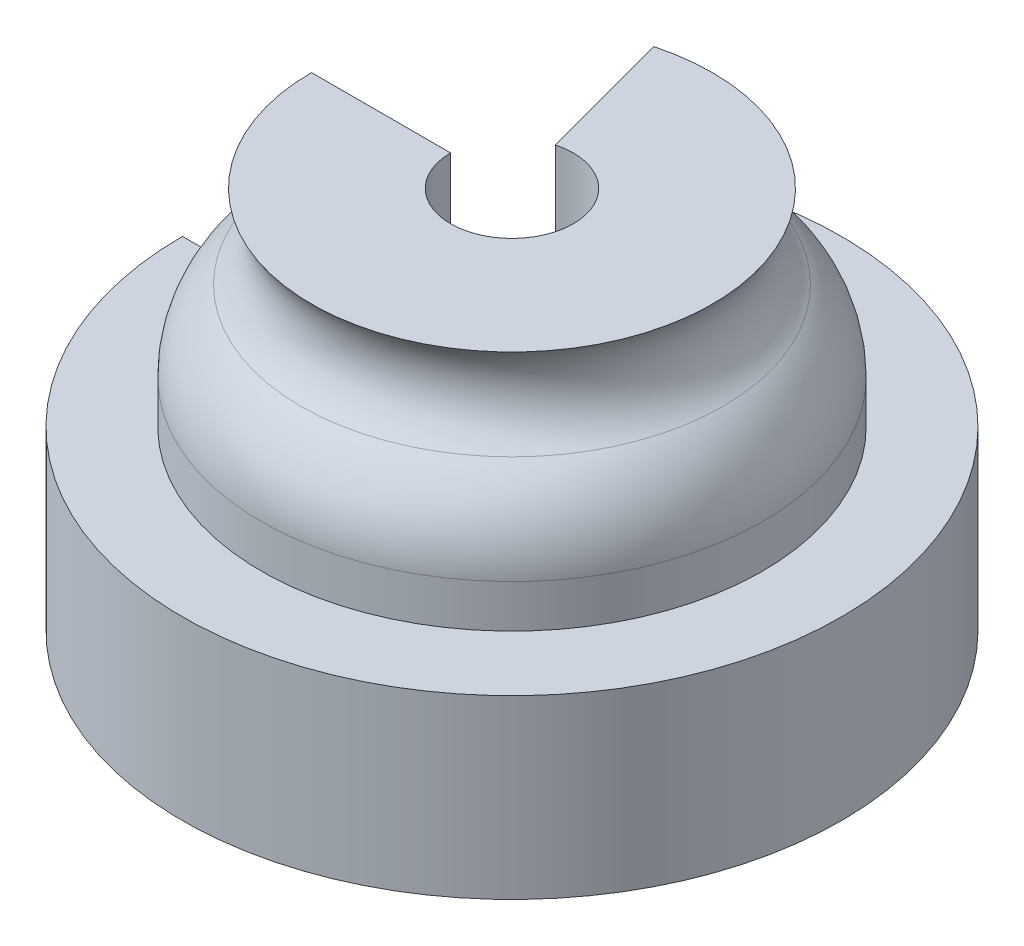
ISO-10303-21;
HEADER;
FILE_DESCRIPTION(('STEP AP214'),'2;1');
FILE_NAME('part.step','',(''),(''),'','','');
FILE_SCHEMA(('AUTOMOTIVE_DESIGN { 1 0 10303 214 1 1 1 1 }'));
ENDSEC;
DATA;
#1=APPLICATION_CONTEXT('core data for automotive mechanical design processes');
#2=APPLICATION_PROTOCOL_DEFINITION('international standard','automotive_design',2000,#1);
#3=PRODUCT_CONTEXT('',#1,'mechanical');
#4=PRODUCT('Part','Part','',(#3));
#5=PRODUCT_RELATED_PRODUCT_CATEGORY('part','',(#4));
#6=PRODUCT_DEFINITION_FORMATION('','',#4);
#7=PRODUCT_DEFINITION_CONTEXT('part definition',#1,'design');
#8=PRODUCT_DEFINITION('design','',#6,#7);
#9=PRODUCT_DEFINITION_SHAPE('','',#8);
#10=(LENGTH_UNIT() NAMED_UNIT(*) SI_UNIT(.MILLI.,.METRE.));
#11=(NAMED_UNIT(*) PLANE_ANGLE_UNIT() SI_UNIT($,.RADIAN.));
#12=(NAMED_UNIT(*) SI_UNIT($,.STERADIAN.) SOLID_ANGLE_UNIT());
#13=UNCERTAINTY_MEASURE_WITH_UNIT(LENGTH_MEASURE(1.E-05),#10,'distance_accuracy_value','');
#14=(GEOMETRIC_REPRESENTATION_CONTEXT(3) GLOBAL_UNCERTAINTY_ASSIGNED_CONTEXT((#13)) GLOBAL_UNIT_ASSIGNED_CONTEXT((#10,
#11,#12)) REPRESENTATION_CONTEXT('',''));
#15=CARTESIAN_POINT('',(0.,0.,0.));
#16=DIRECTION('',(0.,0.,1.));
#17=DIRECTION('',(1.,0.,0.));
#18=AXIS2_PLACEMENT_3D('',#15,#16,#17);
#19=CARTESIAN_POINT('',(-7.03311507822036,34.0911466692464,-26.247942807396));
#20=DIRECTION('',(0.965925826289065,0.,-0.258819045102531));
#21=DIRECTION('',(-0.258819045102531,0.,-0.965925826289065));
#22=AXIS2_PLACEMENT_3D('',#19,#20,#21);
#23=PLANE('',#22);
#24=DIRECTION('',(0.258819045102531,0.,0.965925826289065));
#25=VECTOR('',#24,1.);
#26=CARTESIAN_POINT('',(-7.03311507822036,-4.,-26.247942807396));
#27=LINE('',#26,#25);
#28=CARTESIAN_POINT('',(-9.37629092757959,-4.,-34.9927941282726));
#29=VERTEX_POINT('',#28);
#30=CARTESIAN_POINT('',(-1.74618892919665,-4.,-6.51686580337591));
#31=VERTEX_POINT('',#30);
#32=EDGE_CURVE('E238',#29,#31,#27,.T.);
#33=ORIENTED_EDGE('',*,*,#32,.T.);
#34=DIRECTION('',(0.,1.,0.));
#35=VECTOR('',#34,1.);
#36=CARTESIAN_POINT('',(-1.74618892919665,34.0911466692464,-6.51686580337591));
#37=LINE('',#36,#35);
#38=CARTESIAN_POINT('',(-1.74618892919665,38.0911466692464,-6.51686580337591));
#39=VERTEX_POINT('',#38);
#40=EDGE_CURVE('E241',#31,#39,#37,.T.);
#41=ORIENTED_EDGE('',*,*,#40,.T.);
#42=DIRECTION('',(-0.258819045102531,0.,-0.965925826289065));
#43=VECTOR('',#42,1.);
#44=CARTESIAN_POINT('',(-7.03311507822036,38.0911466692464,-26.247942807396));
#45=LINE('',#44,#43);
#46=CARTESIAN_POINT('',(-5.70418653603872,38.0911466692464,-21.2883139683459));
#47=VERTEX_POINT('',#46);
#48=EDGE_CURVE('E244',#39,#47,#45,.T.);
#49=ORIENTED_EDGE('',*,*,#48,.T.);
#50=CARTESIAN_POINT('',(-7.03311507822036,34.0911466692464,-26.247942807396));
#51=DIRECTION('',(0.965925826289065,0.,-0.258819045102531));
#52=DIRECTION('',(-0.258819045102531,0.,-0.965925826289065));
#53=AXIS2_PLACEMENT_3D('',#50,#51,#52);
#54=CIRCLE('',#53,6.50876096437431);
#55=CARTESIAN_POINT('',(-6.00541743260004,28.9338836760073,-22.4125229791222));
#56=VERTEX_POINT('',#55);
#57=EDGE_CURVE('E247',#47,#56,#54,.T.);
#58=ORIENTED_EDGE('',*,*,#57,.T.);
#59=CARTESIAN_POINT('',(-4.24996507300734,20.1245519342216,-15.8610855828559));
#60=DIRECTION('',(0.965925826289065,0.,-0.258819045102531));
#61=DIRECTION('',(-0.258819045102531,0.,-0.965925826289065));
#62=AXIS2_PLACEMENT_3D('',#59,#60,#61);
#63=CIRCLE('',#62,11.1178806739787);
#64=CARTESIAN_POINT('',(-7.12748433261041,20.1245519342216,-26.600133659452));
#65=VERTEX_POINT('',#64);
#66=EDGE_CURVE('E250',#56,#65,#63,.F.);
#67=ORIENTED_EDGE('',*,*,#66,.T.);
#68=DIRECTION('',(0.,-1.,0.));
#69=VECTOR('',#68,1.);
#70=CARTESIAN_POINT('',(-7.12748433261041,34.0911466692464,-26.600133659452));
#71=LINE('',#70,#69);
#72=CARTESIAN_POINT('',(-7.12748433261041,15.4039294880772,-26.600133659452));
#73=VERTEX_POINT('',#72);
#74=EDGE_CURVE('E253',#65,#73,#71,.T.);
#75=ORIENTED_EDGE('',*,*,#74,.T.);
#76=DIRECTION('',(-0.258819045102531,0.,-0.965925826289065));
#77=VECTOR('',#76,1.);
#78=CARTESIAN_POINT('',(-7.03311507822036,15.4039294880772,-26.247942807396));
#79=LINE('',#78,#77);
#80=CARTESIAN_POINT('',(-9.37629092757959,15.4039294880772,-34.9927941282726));
#81=VERTEX_POINT('',#80);
#82=EDGE_CURVE('E256',#73,#81,#79,.T.);
#83=ORIENTED_EDGE('',*,*,#82,.T.);
#84=DIRECTION('',(0.,-1.,0.));
#85=VECTOR('',#84,1.);
#86=CARTESIAN_POINT('',(-9.37629092757959,34.0911466692464,-34.9927941282726));
#87=LINE('',#86,#85);
#88=EDGE_CURVE('E259',#81,#29,#87,.T.);
#89=ORIENTED_EDGE('',*,*,#88,.T.);
#90=EDGE_LOOP('',(#33,#41,#49,#58,#67,#75,#83,#89));
#91=FACE_BOUND('',#90,.T.);
#92=DIRECTION('',(0.258819045102531,0.,0.965925826289065));
#93=VECTOR('',#92,1.);
#94=CARTESIAN_POINT('',(-8.34101474716946,0.,-31.1290908231163));
#95=LINE('',#94,#93);
#96=CARTESIAN_POINT('',(-8.34101474716946,0.,-31.1290908231163));
#97=VERTEX_POINT('',#96);
#98=CARTESIAN_POINT('',(-2.78146510960678,0.,-10.3805691085322));
#99=VERTEX_POINT('',#98);
#100=EDGE_CURVE('E50',#97,#99,#95,.T.);
#101=ORIENTED_EDGE('',*,*,#100,.F.);
#102=DIRECTION('',(0.,-1.,0.));
#103=VECTOR('',#102,1.);
#104=CARTESIAN_POINT('',(-8.34101474716946,11.4039294880772,-31.1290908231163));
#105=LINE('',#104,#103);
#106=CARTESIAN_POINT('',(-8.34101474716946,11.4039294880772,-31.1290908231163));
#107=VERTEX_POINT('',#106);
#108=EDGE_CURVE('E155',#107,#97,#105,.T.);
#109=ORIENTED_EDGE('',*,*,#108,.F.);
#110=DIRECTION('',(-0.258819045102531,0.,-0.965925826289065));
#111=VECTOR('',#110,1.);
#112=CARTESIAN_POINT('',(-6.09220815220029,11.4039294880772,-22.7364303542958));
#113=LINE('',#112,#111);
#114=CARTESIAN_POINT('',(-6.09220815220029,11.4039294880772,-22.7364303542958));
#115=VERTEX_POINT('',#114);
#116=EDGE_CURVE('E196',#115,#107,#113,.T.);
#117=ORIENTED_EDGE('',*,*,#116,.F.);
#118=DIRECTION('',(0.,-1.,0.));
#119=VECTOR('',#118,1.);
#120=CARTESIAN_POINT('',(-6.09220815220029,20.1245519342216,-22.7364303542958));
#121=LINE('',#120,#119);
#122=CARTESIAN_POINT('',(-6.09220815220029,20.1245519342216,-22.7364303542958));
#123=VERTEX_POINT('',#122);
#124=EDGE_CURVE('E193',#123,#115,#121,.T.);
#125=ORIENTED_EDGE('',*,*,#124,.F.);
#126=CARTESIAN_POINT('',(-4.24996507300734,20.1245519342216,-15.8610855828559));
#127=DIRECTION('',(-0.965925826289065,0.,0.258819045102531));
#128=DIRECTION('',(0.258819045102531,0.,0.965925826289065));
#129=AXIS2_PLACEMENT_3D('',#126,#127,#128);
#130=CIRCLE('',#129,7.11788067397874);
#131=CARTESIAN_POINT('',(-5.37383937880735,25.7644552570088,-20.0554415934225));
#132=VERTEX_POINT('',#131);
#133=EDGE_CURVE('E190',#132,#123,#130,.T.);
#134=ORIENTED_EDGE('',*,*,#133,.F.);
#135=CARTESIAN_POINT('',(-7.03311507822036,34.0911466692464,-26.247942807396));
#136=DIRECTION('',(0.965925826289065,0.,-0.258819045102531));
#137=DIRECTION('',(-0.258819045102531,0.,-0.965925826289065));
#138=AXIS2_PLACEMENT_3D('',#135,#136,#137);
#139=CIRCLE('',#138,10.5087609643743);
#140=CARTESIAN_POINT('',(-4.31324760021025,34.0911466692464,-16.0972591896085));
#141=VERTEX_POINT('',#140);
#142=EDGE_CURVE('E187',#141,#132,#139,.T.);
#143=ORIENTED_EDGE('',*,*,#142,.F.);
#144=DIRECTION('',(-0.258819045102531,0.,-0.965925826289065));
#145=VECTOR('',#144,1.);
#146=CARTESIAN_POINT('',(-2.78146510960678,34.0911466692464,-10.3805691085322));
#147=LINE('',#146,#145);
#148=CARTESIAN_POINT('',(-2.78146510960678,34.0911466692464,-10.3805691085322));
#149=VERTEX_POINT('',#148);
#150=EDGE_CURVE('E184',#149,#141,#147,.T.);
#151=ORIENTED_EDGE('',*,*,#150,.F.);
#152=DIRECTION('',(0.,1.,0.));
#153=VECTOR('',#152,1.);
#154=CARTESIAN_POINT('',(-2.78146510960678,0.,-10.3805691085322));
#155=LINE('',#154,#153);
#156=EDGE_CURVE('E182',#99,#149,#155,.T.);
#157=ORIENTED_EDGE('',*,*,#156,.F.);
#158=EDGE_LOOP('',(#101,#109,#117,#125,#134,#143,#151,#157));
#159=FACE_BOUND('',#158,.T.);
#160=ADVANCED_FACE('F35',(#91,#159),#23,.F.);
#161=CARTESIAN_POINT('',(-27.1738699732633,34.0911466692464,0.));
#162=DIRECTION('',(0.,0.,-1.));
#163=DIRECTION('',(-1.,0.,0.));
#164=AXIS2_PLACEMENT_3D('',#161,#162,#163);
#165=PLANE('',#164);
#166=DIRECTION('',(1.,0.,0.));
#167=VECTOR('',#166,1.);
#168=CARTESIAN_POINT('',(-27.1738699732633,-4.,0.));
#169=LINE('',#168,#167);
#170=CARTESIAN_POINT('',(-36.2272062469945,-4.,0.));
#171=VERTEX_POINT('',#170);
#172=CARTESIAN_POINT('',(-6.74675593716412,-4.,0.));
#173=VERTEX_POINT('',#172);
#174=EDGE_CURVE('E214',#171,#173,#169,.T.);
#175=ORIENTED_EDGE('',*,*,#174,.F.);
#176=DIRECTION('',(0.,-1.,0.));
#177=VECTOR('',#176,1.);
#178=CARTESIAN_POINT('',(-36.2272062469945,34.0911466692464,0.));
#179=LINE('',#178,#177);
#180=CARTESIAN_POINT('',(-36.2272062469945,15.4039294880772,0.));
#181=VERTEX_POINT('',#180);
#182=EDGE_CURVE('E235',#181,#171,#179,.T.);
#183=ORIENTED_EDGE('',*,*,#182,.F.);
#184=DIRECTION('',(-1.,0.,0.));
#185=VECTOR('',#184,1.);
#186=CARTESIAN_POINT('',(-27.1738699732633,15.4039294880772,0.));
#187=LINE('',#186,#185);
#188=CARTESIAN_POINT('',(-27.5384847733553,15.4039294880772,0.));
#189=VERTEX_POINT('',#188);
#190=EDGE_CURVE('E232',#189,#181,#187,.T.);
#191=ORIENTED_EDGE('',*,*,#190,.F.);
#192=DIRECTION('',(0.,-1.,0.));
#193=VECTOR('',#192,1.);
#194=CARTESIAN_POINT('',(-27.5384847733553,34.0911466692464,0.));
#195=LINE('',#194,#193);
#196=CARTESIAN_POINT('',(-27.5384847733553,20.1245519342216,0.));
#197=VERTEX_POINT('',#196);
#198=EDGE_CURVE('E229',#197,#189,#195,.T.);
#199=ORIENTED_EDGE('',*,*,#198,.F.);
#200=CARTESIAN_POINT('',(-16.4206040993765,20.1245519342216,0.));
#201=DIRECTION('',(0.,0.,-1.));
#202=DIRECTION('',(-1.,0.,0.));
#203=AXIS2_PLACEMENT_3D('',#200,#201,#202);
#204=CIRCLE('',#203,11.1178806739787);
#205=CARTESIAN_POINT('',(-23.2031511831789,28.9338836760073,0.));
#206=VERTEX_POINT('',#205);
#207=EDGE_CURVE('E226',#206,#197,#204,.F.);
#208=ORIENTED_EDGE('',*,*,#207,.F.);
#209=CARTESIAN_POINT('',(-27.1738699732633,34.0911466692464,0.));
#210=DIRECTION('',(0.,0.,-1.));
#211=DIRECTION('',(-1.,0.,0.));
#212=AXIS2_PLACEMENT_3D('',#209,#210,#211);
#213=CIRCLE('',#212,6.50876096437431);
#214=CARTESIAN_POINT('',(-22.0392843725198,38.0911466692464,0.));
#215=VERTEX_POINT('',#214);
#216=EDGE_CURVE('E223',#215,#206,#213,.T.);
#217=ORIENTED_EDGE('',*,*,#216,.F.);
#218=DIRECTION('',(-1.,0.,0.));
#219=VECTOR('',#218,1.);
#220=CARTESIAN_POINT('',(-27.1738699732633,38.0911466692464,0.));
#221=LINE('',#220,#219);
#222=CARTESIAN_POINT('',(-6.74675593716412,38.0911466692464,0.));
#223=VERTEX_POINT('',#222);
#224=EDGE_CURVE('E220',#223,#215,#221,.T.);
#225=ORIENTED_EDGE('',*,*,#224,.F.);
#226=DIRECTION('',(0.,1.,0.));
#227=VECTOR('',#226,1.);
#228=CARTESIAN_POINT('',(-6.74675593716412,34.0911466692464,0.));
#229=LINE('',#228,#227);
#230=EDGE_CURVE('E217',#173,#223,#229,.T.);
#231=ORIENTED_EDGE('',*,*,#230,.F.);
#232=EDGE_LOOP('',(#175,#183,#191,#199,#208,#217,#225,#231));
#233=FACE_BOUND('',#232,.T.);
#234=DIRECTION('',(0.,-1.,0.));
#235=VECTOR('',#234,1.);
#236=CARTESIAN_POINT('',(-32.2272062469945,11.4039294880772,0.));
#237=LINE('',#236,#235);
#238=CARTESIAN_POINT('',(-32.2272062469945,11.4039294880772,0.));
#239=VERTEX_POINT('',#238);
#240=CARTESIAN_POINT('',(-32.2272062469945,0.,0.));
#241=VERTEX_POINT('',#240);
#242=EDGE_CURVE('E165',#239,#241,#237,.T.);
#243=ORIENTED_EDGE('',*,*,#242,.T.);
#244=DIRECTION('',(1.,0.,0.));
#245=VECTOR('',#244,1.);
#246=CARTESIAN_POINT('',(-32.2272062469945,0.,0.));
#247=LINE('',#246,#245);
#248=CARTESIAN_POINT('',(-10.7467559371641,0.,0.));
#249=VERTEX_POINT('',#248);
#250=EDGE_CURVE('E149',#241,#249,#247,.T.);
#251=ORIENTED_EDGE('',*,*,#250,.T.);
#252=DIRECTION('',(0.,1.,0.));
#253=VECTOR('',#252,1.);
#254=CARTESIAN_POINT('',(-10.7467559371641,0.,0.));
#255=LINE('',#254,#253);
#256=CARTESIAN_POINT('',(-10.7467559371641,34.0911466692464,0.));
#257=VERTEX_POINT('',#256);
#258=EDGE_CURVE('E158',#249,#257,#255,.T.);
#259=ORIENTED_EDGE('',*,*,#258,.T.);
#260=DIRECTION('',(-1.,0.,0.));
#261=VECTOR('',#260,1.);
#262=CARTESIAN_POINT('',(-10.7467559371641,34.0911466692464,0.));
#263=LINE('',#262,#261);
#264=CARTESIAN_POINT('',(-16.665109008889,34.0911466692464,0.));
#265=VERTEX_POINT('',#264);
#266=EDGE_CURVE('E58',#257,#265,#263,.T.);
#267=ORIENTED_EDGE('',*,*,#266,.T.);
#268=CARTESIAN_POINT('',(-27.1738699732633,34.0911466692464,0.));
#269=DIRECTION('',(0.,0.,-1.));
#270=DIRECTION('',(-1.,0.,0.));
#271=AXIS2_PLACEMENT_3D('',#268,#269,#270);
#272=CIRCLE('',#271,10.5087609643743);
#273=CARTESIAN_POINT('',(-20.762920969276,25.7644552570088,0.));
#274=VERTEX_POINT('',#273);
#275=EDGE_CURVE('E169',#265,#274,#272,.T.);
#276=ORIENTED_EDGE('',*,*,#275,.T.);
#277=CARTESIAN_POINT('',(-16.4206040993765,20.1245519342216,0.));
#278=DIRECTION('',(0.,0.,1.));
#279=DIRECTION('',(1.,0.,0.));
#280=AXIS2_PLACEMENT_3D('',#277,#278,#279);
#281=CIRCLE('',#280,7.11788067397874);
#282=CARTESIAN_POINT('',(-23.5384847733553,20.1245519342216,0.));
#283=VERTEX_POINT('',#282);
#284=EDGE_CURVE('E172',#274,#283,#281,.T.);
#285=ORIENTED_EDGE('',*,*,#284,.T.);
#286=DIRECTION('',(0.,-1.,0.));
#287=VECTOR('',#286,1.);
#288=CARTESIAN_POINT('',(-23.5384847733553,20.1245519342216,0.));
#289=LINE('',#288,#287);
#290=CARTESIAN_POINT('',(-23.5384847733553,11.4039294880772,0.));
#291=VERTEX_POINT('',#290);
#292=EDGE_CURVE('E175',#283,#291,#289,.T.);
#293=ORIENTED_EDGE('',*,*,#292,.T.);
#294=DIRECTION('',(-1.,0.,0.));
#295=VECTOR('',#294,1.);
#296=CARTESIAN_POINT('',(-23.5384847733553,11.4039294880772,0.));
#297=LINE('',#296,#295);
#298=EDGE_CURVE('E178',#291,#239,#297,.T.);
#299=ORIENTED_EDGE('',*,*,#298,.T.);
#300=EDGE_LOOP('',(#243,#251,#259,#267,#276,#285,#293,#299));
#301=FACE_BOUND('',#300,.T.);
#302=ADVANCED_FACE('F162',(#233,#301),#165,.T.);
#303=CARTESIAN_POINT('',(-7.03311507822036,-4.,-26.247942807396));
#304=DIRECTION('',(0.,1.,0.));
#305=DIRECTION('',(0.,0.,1.));
#306=AXIS2_PLACEMENT_3D('',#303,#304,#305);
#307=PLANE('',#306);
#308=CARTESIAN_POINT('',(0.,-4.,0.));
#309=DIRECTION('',(0.,-1.,0.));
#310=DIRECTION('',(0.,0.,-1.));
#311=AXIS2_PLACEMENT_3D('',#308,#309,#310);
#312=CIRCLE('',#311,36.2272062469945);
#313=EDGE_CURVE('E11',#29,#171,#312,.T.);
#314=ORIENTED_EDGE('',*,*,#313,.T.);
#315=ORIENTED_EDGE('',*,*,#174,.T.);
#316=CARTESIAN_POINT('',(0.,-4.,0.));
#317=DIRECTION('',(0.,-1.,0.));
#318=DIRECTION('',(0.,0.,-1.));
#319=AXIS2_PLACEMENT_3D('',#316,#317,#318);
#320=CIRCLE('',#319,6.74675593716412);
#321=EDGE_CURVE('E262',#31,#173,#320,.T.);
#322=ORIENTED_EDGE('',*,*,#321,.F.);
#323=ORIENTED_EDGE('',*,*,#32,.F.);
#324=EDGE_LOOP('',(#314,#315,#322,#323));
#325=FACE_BOUND('',#324,.T.);
#326=ADVANCED_FACE('F286',(#325),#307,.F.);
#327=CARTESIAN_POINT('',(0.,0.,0.));
#328=DIRECTION('',(0.,-1.,0.));
#329=DIRECTION('',(0.,0.,-1.));
#330=AXIS2_PLACEMENT_3D('',#327,#328,#329);
#331=CYLINDRICAL_SURFACE('',#330,36.2272062469945);
#332=CARTESIAN_POINT('',(0.,15.4039294880772,0.));
#333=DIRECTION('',(0.,-1.,0.));
#334=DIRECTION('',(0.,0.,-1.));
#335=AXIS2_PLACEMENT_3D('',#332,#333,#334);
#336=CIRCLE('',#335,36.2272062469945);
#337=EDGE_CURVE('E43',#81,#181,#336,.T.);
#338=ORIENTED_EDGE('',*,*,#337,.T.);
#339=ORIENTED_EDGE('',*,*,#182,.T.);
#340=ORIENTED_EDGE('',*,*,#313,.F.);
#341=ORIENTED_EDGE('',*,*,#88,.F.);
#342=EDGE_LOOP('',(#338,#339,#340,#341));
#343=FACE_BOUND('',#342,.T.);
#344=ADVANCED_FACE('F37',(#343),#331,.T.);
#345=CARTESIAN_POINT('',(-7.03311507822036,15.4039294880772,-26.247942807396));
#346=DIRECTION('',(0.,-1.,0.));
#347=DIRECTION('',(0.,0.,-1.));
#348=AXIS2_PLACEMENT_3D('',#345,#346,#347);
#349=PLANE('',#348);
#350=CARTESIAN_POINT('',(0.,15.4039294880772,0.));
#351=DIRECTION('',(0.,-1.,0.));
#352=DIRECTION('',(0.,0.,-1.));
#353=AXIS2_PLACEMENT_3D('',#350,#351,#352);
#354=CIRCLE('',#353,27.5384847733553);
#355=EDGE_CURVE('E272',#73,#189,#354,.T.);
#356=ORIENTED_EDGE('',*,*,#355,.T.);
#357=ORIENTED_EDGE('',*,*,#190,.T.);
#358=ORIENTED_EDGE('',*,*,#337,.F.);
#359=ORIENTED_EDGE('',*,*,#82,.F.);
#360=EDGE_LOOP('',(#356,#357,#358,#359));
#361=FACE_BOUND('',#360,.T.);
#362=ADVANCED_FACE('F280',(#361),#349,.F.);
#363=CARTESIAN_POINT('',(0.,0.,0.));
#364=DIRECTION('',(0.,-1.,0.));
#365=DIRECTION('',(0.,0.,-1.));
#366=AXIS2_PLACEMENT_3D('',#363,#364,#365);
#367=CYLINDRICAL_SURFACE('',#366,27.5384847733553);
#368=CARTESIAN_POINT('',(0.,20.1245519342216,0.));
#369=DIRECTION('',(0.,-1.,0.));
#370=DIRECTION('',(0.,0.,-1.));
#371=AXIS2_PLACEMENT_3D('',#368,#369,#370);
#372=CIRCLE('',#371,27.5384847733553);
#373=EDGE_CURVE('E270',#65,#197,#372,.T.);
#374=ORIENTED_EDGE('',*,*,#373,.T.);
#375=ORIENTED_EDGE('',*,*,#198,.T.);
#376=ORIENTED_EDGE('',*,*,#355,.F.);
#377=ORIENTED_EDGE('',*,*,#74,.F.);
#378=EDGE_LOOP('',(#374,#375,#376,#377));
#379=FACE_BOUND('',#378,.T.);
#380=ADVANCED_FACE('F294',(#379),#367,.T.);
#381=CARTESIAN_POINT('',(0.,20.1245519342216,0.));
#382=DIRECTION('',(0.,-1.,0.));
#383=DIRECTION('',(0.,0.,-1.));
#384=AXIS2_PLACEMENT_3D('',#381,#382,#383);
#385=TOROIDAL_SURFACE('',#384,16.4206040993765,11.1178806739787);
#386=CARTESIAN_POINT('',(0.,28.9338836760073,0.));
#387=DIRECTION('',(0.,-1.,0.));
#388=DIRECTION('',(0.,0.,-1.));
#389=AXIS2_PLACEMENT_3D('',#386,#387,#388);
#390=CIRCLE('',#389,23.2031511831789);
#391=EDGE_CURVE('E268',#56,#206,#390,.T.);
#392=ORIENTED_EDGE('',*,*,#391,.T.);
#393=ORIENTED_EDGE('',*,*,#207,.T.);
#394=ORIENTED_EDGE('',*,*,#373,.F.);
#395=ORIENTED_EDGE('',*,*,#66,.F.);
#396=EDGE_LOOP('',(#392,#393,#394,#395));
#397=FACE_BOUND('',#396,.T.);
#398=ADVANCED_FACE('F298',(#397),#385,.T.);
#399=CARTESIAN_POINT('',(0.,34.0911466692464,0.));
#400=DIRECTION('',(0.,-1.,0.));
#401=DIRECTION('',(0.,0.,-1.));
#402=AXIS2_PLACEMENT_3D('',#399,#400,#401);
#403=TOROIDAL_SURFACE('',#402,27.1738699732633,6.50876096437431);
#404=CARTESIAN_POINT('',(0.,38.0911466692464,0.));
#405=DIRECTION('',(0.,-1.,0.));
#406=DIRECTION('',(0.,0.,-1.));
#407=AXIS2_PLACEMENT_3D('',#404,#405,#406);
#408=CIRCLE('',#407,22.0392843725198);
#409=EDGE_CURVE('E266',#47,#215,#408,.T.);
#410=ORIENTED_EDGE('',*,*,#409,.T.);
#411=ORIENTED_EDGE('',*,*,#216,.T.);
#412=ORIENTED_EDGE('',*,*,#391,.F.);
#413=ORIENTED_EDGE('',*,*,#57,.F.);
#414=EDGE_LOOP('',(#410,#411,#412,#413));
#415=FACE_BOUND('',#414,.T.);
#416=ADVANCED_FACE('F301',(#415),#403,.F.);
#417=CARTESIAN_POINT('',(-7.03311507822036,38.0911466692464,-26.247942807396));
#418=DIRECTION('',(0.,-1.,0.));
#419=DIRECTION('',(0.,0.,-1.));
#420=AXIS2_PLACEMENT_3D('',#417,#418,#419);
#421=PLANE('',#420);
#422=CARTESIAN_POINT('',(0.,38.0911466692464,0.));
#423=DIRECTION('',(0.,-1.,0.));
#424=DIRECTION('',(0.,0.,-1.));
#425=AXIS2_PLACEMENT_3D('',#422,#423,#424);
#426=CIRCLE('',#425,6.74675593716412);
#427=EDGE_CURVE('E264',#39,#223,#426,.T.);
#428=ORIENTED_EDGE('',*,*,#427,.T.);
#429=ORIENTED_EDGE('',*,*,#224,.T.);
#430=ORIENTED_EDGE('',*,*,#409,.F.);
#431=ORIENTED_EDGE('',*,*,#48,.F.);
#432=EDGE_LOOP('',(#428,#429,#430,#431));
#433=FACE_BOUND('',#432,.T.);
#434=ADVANCED_FACE('F304',(#433),#421,.F.);
#435=CARTESIAN_POINT('',(0.,0.,0.));
#436=DIRECTION('',(0.,-1.,0.));
#437=DIRECTION('',(0.,0.,-1.));
#438=AXIS2_PLACEMENT_3D('',#435,#436,#437);
#439=CYLINDRICAL_SURFACE('',#438,6.74675593716412);
#440=ORIENTED_EDGE('',*,*,#40,.F.);
#441=ORIENTED_EDGE('',*,*,#321,.T.);
#442=ORIENTED_EDGE('',*,*,#230,.T.);
#443=ORIENTED_EDGE('',*,*,#427,.F.);
#444=EDGE_LOOP('',(#440,#441,#442,#443));
#445=FACE_BOUND('',#444,.T.);
#446=ADVANCED_FACE('F306',(#445),#439,.F.);
#447=CARTESIAN_POINT('',(-8.34101474716946,0.,-31.1290908231163));
#448=DIRECTION('',(0.,1.,0.));
#449=DIRECTION('',(0.,0.,1.));
#450=AXIS2_PLACEMENT_3D('',#447,#448,#449);
#451=PLANE('',#450);
#452=CARTESIAN_POINT('',(0.,0.,0.));
#453=DIRECTION('',(0.,-1.,0.));
#454=DIRECTION('',(0.,0.,-1.));
#455=AXIS2_PLACEMENT_3D('',#452,#453,#454);
#456=CIRCLE('',#455,32.2272062469945);
#457=EDGE_CURVE('E212',#97,#241,#456,.T.);
#458=ORIENTED_EDGE('',*,*,#457,.F.);
#459=ORIENTED_EDGE('',*,*,#100,.T.);
#460=CARTESIAN_POINT('',(0.,0.,0.));
#461=DIRECTION('',(0.,-1.,0.));
#462=DIRECTION('',(0.,0.,-1.));
#463=AXIS2_PLACEMENT_3D('',#460,#461,#462);
#464=CIRCLE('',#463,10.7467559371641);
#465=EDGE_CURVE('E145',#99,#249,#464,.T.);
#466=ORIENTED_EDGE('',*,*,#465,.T.);
#467=ORIENTED_EDGE('',*,*,#250,.F.);
#468=EDGE_LOOP('',(#458,#459,#466,#467));
#469=FACE_BOUND('',#468,.T.);
#470=ADVANCED_FACE('F147',(#469),#451,.T.);
#471=CARTESIAN_POINT('',(0.,0.,0.));
#472=DIRECTION('',(0.,-1.,0.));
#473=DIRECTION('',(0.,0.,-1.));
#474=AXIS2_PLACEMENT_3D('',#471,#472,#473);
#475=CYLINDRICAL_SURFACE('',#474,32.2272062469945);
#476=CARTESIAN_POINT('',(0.,11.4039294880772,0.));
#477=DIRECTION('',(0.,-1.,0.));
#478=DIRECTION('',(0.,0.,-1.));
#479=AXIS2_PLACEMENT_3D('',#476,#477,#478);
#480=CIRCLE('',#479,32.2272062469945);
#481=EDGE_CURVE('E210',#107,#239,#480,.T.);
#482=ORIENTED_EDGE('',*,*,#481,.F.);
#483=ORIENTED_EDGE('',*,*,#108,.T.);
#484=ORIENTED_EDGE('',*,*,#457,.T.);
#485=ORIENTED_EDGE('',*,*,#242,.F.);
#486=EDGE_LOOP('',(#482,#483,#484,#485));
#487=FACE_BOUND('',#486,.T.);
#488=ADVANCED_FACE('F313',(#487),#475,.F.);
#489=CARTESIAN_POINT('',(-6.09220815220029,11.4039294880772,-22.7364303542958));
#490=DIRECTION('',(0.,-1.,0.));
#491=DIRECTION('',(0.,0.,-1.));
#492=AXIS2_PLACEMENT_3D('',#489,#490,#491);
#493=PLANE('',#492);
#494=CARTESIAN_POINT('',(0.,11.4039294880772,0.));
#495=DIRECTION('',(0.,-1.,0.));
#496=DIRECTION('',(0.,0.,-1.));
#497=AXIS2_PLACEMENT_3D('',#494,#495,#496);
#498=CIRCLE('',#497,23.5384847733553);
#499=EDGE_CURVE('E208',#115,#291,#498,.T.);
#500=ORIENTED_EDGE('',*,*,#499,.F.);
#501=ORIENTED_EDGE('',*,*,#116,.T.);
#502=ORIENTED_EDGE('',*,*,#481,.T.);
#503=ORIENTED_EDGE('',*,*,#298,.F.);
#504=EDGE_LOOP('',(#500,#501,#502,#503));
#505=FACE_BOUND('',#504,.T.);
#506=ADVANCED_FACE('F366',(#505),#493,.T.);
#507=CARTESIAN_POINT('',(0.,0.,0.));
#508=DIRECTION('',(0.,-1.,0.));
#509=DIRECTION('',(0.,0.,-1.));
#510=AXIS2_PLACEMENT_3D('',#507,#508,#509);
#511=CYLINDRICAL_SURFACE('',#510,23.5384847733553);
#512=CARTESIAN_POINT('',(0.,20.1245519342216,0.));
#513=DIRECTION('',(0.,-1.,0.));
#514=DIRECTION('',(0.,0.,-1.));
#515=AXIS2_PLACEMENT_3D('',#512,#513,#514);
#516=CIRCLE('',#515,23.5384847733553);
#517=EDGE_CURVE('E206',#123,#283,#516,.T.);
#518=ORIENTED_EDGE('',*,*,#517,.F.);
#519=ORIENTED_EDGE('',*,*,#124,.T.);
#520=ORIENTED_EDGE('',*,*,#499,.T.);
#521=ORIENTED_EDGE('',*,*,#292,.F.);
#522=EDGE_LOOP('',(#518,#519,#520,#521));
#523=FACE_BOUND('',#522,.T.);
#524=ADVANCED_FACE('F375',(#523),#511,.F.);
#525=CARTESIAN_POINT('',(0.,20.1245519342216,0.));
#526=DIRECTION('',(0.,-1.,0.));
#527=DIRECTION('',(0.,0.,-1.));
#528=AXIS2_PLACEMENT_3D('',#525,#526,#527);
#529=TOROIDAL_SURFACE('',#528,16.4206040993765,7.11788067397874);
#530=CARTESIAN_POINT('',(0.,25.7644552570088,0.));
#531=DIRECTION('',(0.,-1.,0.));
#532=DIRECTION('',(0.,0.,-1.));
#533=AXIS2_PLACEMENT_3D('',#530,#531,#532);
#534=CIRCLE('',#533,20.762920969276);
#535=EDGE_CURVE('E204',#132,#274,#534,.T.);
#536=ORIENTED_EDGE('',*,*,#535,.F.);
#537=ORIENTED_EDGE('',*,*,#133,.T.);
#538=ORIENTED_EDGE('',*,*,#517,.T.);
#539=ORIENTED_EDGE('',*,*,#284,.F.);
#540=EDGE_LOOP('',(#536,#537,#538,#539));
#541=FACE_BOUND('',#540,.T.);
#542=ADVANCED_FACE('F385',(#541),#529,.F.);
#543=CARTESIAN_POINT('',(0.,34.0911466692464,0.));
#544=DIRECTION('',(0.,-1.,0.));
#545=DIRECTION('',(0.,0.,-1.));
#546=AXIS2_PLACEMENT_3D('',#543,#544,#545);
#547=TOROIDAL_SURFACE('',#546,27.1738699732633,10.5087609643743);
#548=CARTESIAN_POINT('',(0.,34.0911466692464,0.));
#549=DIRECTION('',(0.,-1.,0.));
#550=DIRECTION('',(0.,0.,-1.));
#551=AXIS2_PLACEMENT_3D('',#548,#549,#550);
#552=CIRCLE('',#551,16.665109008889);
#553=EDGE_CURVE('E202',#141,#265,#552,.T.);
#554=ORIENTED_EDGE('',*,*,#553,.F.);
#555=ORIENTED_EDGE('',*,*,#142,.T.);
#556=ORIENTED_EDGE('',*,*,#535,.T.);
#557=ORIENTED_EDGE('',*,*,#275,.F.);
#558=EDGE_LOOP('',(#554,#555,#556,#557));
#559=FACE_BOUND('',#558,.T.);
#560=ADVANCED_FACE('F395',(#559),#547,.T.);
#561=CARTESIAN_POINT('',(-2.78146510960678,34.0911466692464,-10.3805691085322));
#562=DIRECTION('',(0.,-1.,0.));
#563=DIRECTION('',(0.,0.,-1.));
#564=AXIS2_PLACEMENT_3D('',#561,#562,#563);
#565=PLANE('',#564);
#566=CARTESIAN_POINT('',(0.,34.0911466692464,0.));
#567=DIRECTION('',(0.,-1.,0.));
#568=DIRECTION('',(0.,0.,-1.));
#569=AXIS2_PLACEMENT_3D('',#566,#567,#568);
#570=CIRCLE('',#569,10.7467559371641);
#571=EDGE_CURVE('E154',#149,#257,#570,.T.);
#572=ORIENTED_EDGE('',*,*,#571,.F.);
#573=ORIENTED_EDGE('',*,*,#150,.T.);
#574=ORIENTED_EDGE('',*,*,#553,.T.);
#575=ORIENTED_EDGE('',*,*,#266,.F.);
#576=EDGE_LOOP('',(#572,#573,#574,#575));
#577=FACE_BOUND('',#576,.T.);
#578=ADVANCED_FACE('F405',(#577),#565,.T.);
#579=CARTESIAN_POINT('',(0.,0.,0.));
#580=DIRECTION('',(0.,-1.,0.));
#581=DIRECTION('',(0.,0.,-1.));
#582=AXIS2_PLACEMENT_3D('',#579,#580,#581);
#583=CYLINDRICAL_SURFACE('',#582,10.7467559371641);
#584=ORIENTED_EDGE('',*,*,#156,.T.);
#585=ORIENTED_EDGE('',*,*,#571,.T.);
#586=ORIENTED_EDGE('',*,*,#258,.F.);
#587=ORIENTED_EDGE('',*,*,#465,.F.);
#588=EDGE_LOOP('',(#584,#585,#586,#587));
#589=FACE_BOUND('',#588,.T.);
#590=ADVANCED_FACE('F159',(#589),#583,.T.);
#591=CLOSED_SHELL('',(#160,#302,#326,#344,#362,#380,#398,#416,#434,#446,#470,#488,#506,#524,
#542,#560,#578,#590));
#592=MANIFOLD_SOLID_BREP('B2',#591);
#593=ADVANCED_BREP_SHAPE_REPRESENTATION('',(#18,#592),#14);
#594=SHAPE_DEFINITION_REPRESENTATION(#9,#593);
ENDSEC;
END-ISO-10303-21;
